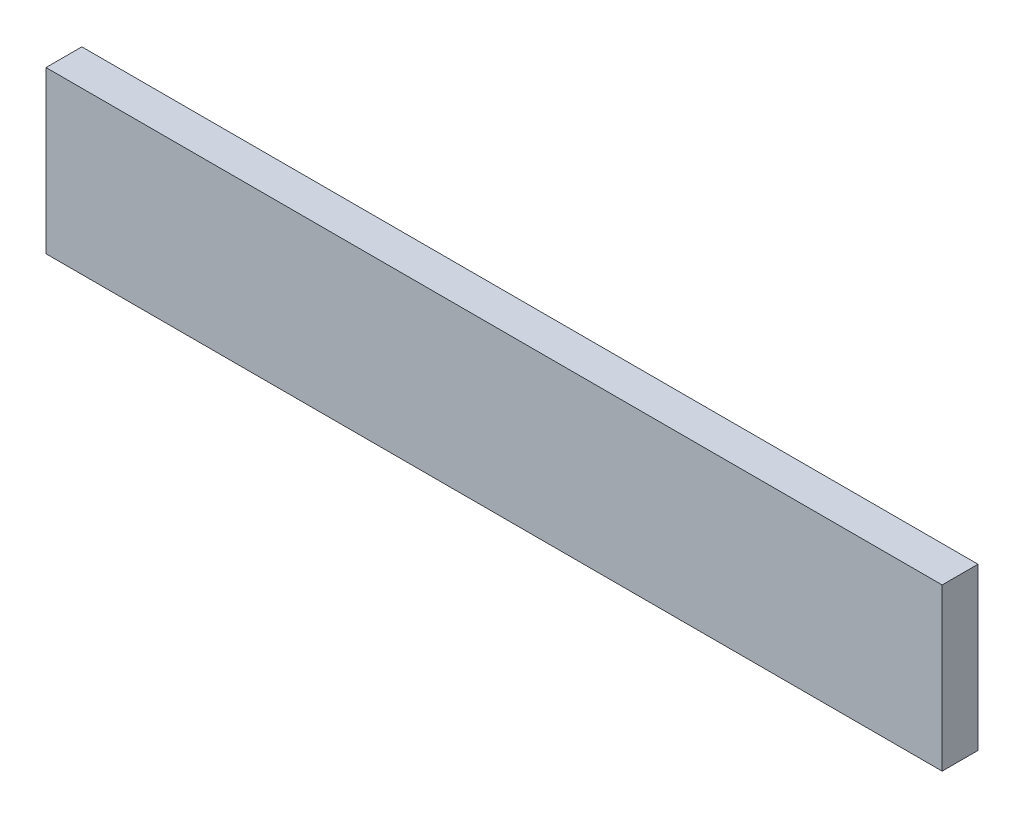
ISO-10303-21;
HEADER;
FILE_DESCRIPTION(('STEP AP214'),'2;1');
FILE_NAME('part.step','',(''),(''),'','','');
FILE_SCHEMA(('AUTOMOTIVE_DESIGN { 1 0 10303 214 1 1 1 1 }'));
ENDSEC;
DATA;
#1=APPLICATION_CONTEXT('core data for automotive mechanical design processes');
#2=APPLICATION_PROTOCOL_DEFINITION('international standard','automotive_design',2000,#1);
#3=PRODUCT_CONTEXT('',#1,'mechanical');
#4=PRODUCT('Part','Part','',(#3));
#5=PRODUCT_RELATED_PRODUCT_CATEGORY('part','',(#4));
#6=PRODUCT_DEFINITION_FORMATION('','',#4);
#7=PRODUCT_DEFINITION_CONTEXT('part definition',#1,'design');
#8=PRODUCT_DEFINITION('design','',#6,#7);
#9=PRODUCT_DEFINITION_SHAPE('','',#8);
#10=(LENGTH_UNIT() NAMED_UNIT(*) SI_UNIT(.MILLI.,.METRE.));
#11=(NAMED_UNIT(*) PLANE_ANGLE_UNIT() SI_UNIT($,.RADIAN.));
#12=(NAMED_UNIT(*) SI_UNIT($,.STERADIAN.) SOLID_ANGLE_UNIT());
#13=UNCERTAINTY_MEASURE_WITH_UNIT(LENGTH_MEASURE(1.E-05),#10,'distance_accuracy_value','');
#14=(GEOMETRIC_REPRESENTATION_CONTEXT(3) GLOBAL_UNCERTAINTY_ASSIGNED_CONTEXT((#13)) GLOBAL_UNIT_ASSIGNED_CONTEXT((#10,
#11,#12)) REPRESENTATION_CONTEXT('',''));
#15=CARTESIAN_POINT('',(0.,0.,0.));
#16=DIRECTION('',(0.,0.,1.));
#17=DIRECTION('',(1.,0.,0.));
#18=AXIS2_PLACEMENT_3D('',#15,#16,#17);
#19=CARTESIAN_POINT('',(0.,0.,10.));
#20=DIRECTION('',(-1.,0.,0.));
#21=DIRECTION('',(0.,0.,1.));
#22=AXIS2_PLACEMENT_3D('',#19,#20,#21);
#23=PLANE('',#22);
#24=DIRECTION('',(0.,1.,0.));
#25=VECTOR('',#24,1.);
#26=CARTESIAN_POINT('',(0.,0.,0.));
#27=LINE('',#26,#25);
#28=CARTESIAN_POINT('',(0.,0.,0.));
#29=VERTEX_POINT('',#28);
#30=CARTESIAN_POINT('',(0.,45.,0.));
#31=VERTEX_POINT('',#30);
#32=EDGE_CURVE('E98',#29,#31,#27,.T.);
#33=ORIENTED_EDGE('',*,*,#32,.T.);
#34=DIRECTION('',(0.,0.,-1.));
#35=VECTOR('',#34,1.);
#36=CARTESIAN_POINT('',(0.,45.,10.));
#37=LINE('',#36,#35);
#38=CARTESIAN_POINT('',(0.,45.,10.));
#39=VERTEX_POINT('',#38);
#40=EDGE_CURVE('E11',#39,#31,#37,.T.);
#41=ORIENTED_EDGE('',*,*,#40,.F.);
#42=DIRECTION('',(0.,1.,0.));
#43=VECTOR('',#42,1.);
#44=CARTESIAN_POINT('',(0.,0.,10.));
#45=LINE('',#44,#43);
#46=CARTESIAN_POINT('',(0.,0.,10.));
#47=VERTEX_POINT('',#46);
#48=EDGE_CURVE('E86',#47,#39,#45,.T.);
#49=ORIENTED_EDGE('',*,*,#48,.F.);
#50=DIRECTION('',(0.,0.,-1.));
#51=VECTOR('',#50,1.);
#52=CARTESIAN_POINT('',(0.,0.,10.));
#53=LINE('',#52,#51);
#54=EDGE_CURVE('E94',#47,#29,#53,.T.);
#55=ORIENTED_EDGE('',*,*,#54,.T.);
#56=EDGE_LOOP('',(#33,#41,#49,#55));
#57=FACE_BOUND('',#56,.T.);
#58=ADVANCED_FACE('F35',(#57),#23,.F.);
#59=CARTESIAN_POINT('',(0.,45.,10.));
#60=DIRECTION('',(0.,-1.,0.));
#61=DIRECTION('',(1.,0.,0.));
#62=AXIS2_PLACEMENT_3D('',#59,#60,#61);
#63=PLANE('',#62);
#64=DIRECTION('',(-1.,0.,0.));
#65=VECTOR('',#64,1.);
#66=CARTESIAN_POINT('',(0.,45.,0.));
#67=LINE('',#66,#65);
#68=CARTESIAN_POINT('',(-250.,45.,0.));
#69=VERTEX_POINT('',#68);
#70=EDGE_CURVE('E90',#31,#69,#67,.T.);
#71=ORIENTED_EDGE('',*,*,#70,.T.);
#72=DIRECTION('',(0.,0.,-1.));
#73=VECTOR('',#72,1.);
#74=CARTESIAN_POINT('',(-250.,45.,10.));
#75=LINE('',#74,#73);
#76=CARTESIAN_POINT('',(-250.,45.,10.));
#77=VERTEX_POINT('',#76);
#78=EDGE_CURVE('E43',#77,#69,#75,.T.);
#79=ORIENTED_EDGE('',*,*,#78,.F.);
#80=DIRECTION('',(-1.,0.,0.));
#81=VECTOR('',#80,1.);
#82=CARTESIAN_POINT('',(0.,45.,10.));
#83=LINE('',#82,#81);
#84=EDGE_CURVE('E81',#39,#77,#83,.T.);
#85=ORIENTED_EDGE('',*,*,#84,.F.);
#86=ORIENTED_EDGE('',*,*,#40,.T.);
#87=EDGE_LOOP('',(#71,#79,#85,#86));
#88=FACE_BOUND('',#87,.T.);
#89=ADVANCED_FACE('F89',(#88),#63,.F.);
#90=CARTESIAN_POINT('',(-250.,0.,10.));
#91=DIRECTION('',(1.,0.,0.));
#92=DIRECTION('',(0.,0.,-1.));
#93=AXIS2_PLACEMENT_3D('',#90,#91,#92);
#94=PLANE('',#93);
#95=DIRECTION('',(0.,-1.,0.));
#96=VECTOR('',#95,1.);
#97=CARTESIAN_POINT('',(-250.,0.,0.));
#98=LINE('',#97,#96);
#99=CARTESIAN_POINT('',(-250.,0.,0.));
#100=VERTEX_POINT('',#99);
#101=EDGE_CURVE('E68',#69,#100,#98,.T.);
#102=ORIENTED_EDGE('',*,*,#101,.T.);
#103=DIRECTION('',(0.,0.,-1.));
#104=VECTOR('',#103,1.);
#105=CARTESIAN_POINT('',(-250.,0.,10.));
#106=LINE('',#105,#104);
#107=CARTESIAN_POINT('',(-250.,0.,10.));
#108=VERTEX_POINT('',#107);
#109=EDGE_CURVE('E91',#108,#100,#106,.T.);
#110=ORIENTED_EDGE('',*,*,#109,.F.);
#111=DIRECTION('',(0.,-1.,0.));
#112=VECTOR('',#111,1.);
#113=CARTESIAN_POINT('',(-250.,0.,10.));
#114=LINE('',#113,#112);
#115=EDGE_CURVE('E84',#77,#108,#114,.T.);
#116=ORIENTED_EDGE('',*,*,#115,.F.);
#117=ORIENTED_EDGE('',*,*,#78,.T.);
#118=EDGE_LOOP('',(#102,#110,#116,#117));
#119=FACE_BOUND('',#118,.T.);
#120=ADVANCED_FACE('F92',(#119),#94,.F.);
#121=CARTESIAN_POINT('',(0.,0.,10.));
#122=DIRECTION('',(0.,1.,0.));
#123=DIRECTION('',(-1.,0.,0.));
#124=AXIS2_PLACEMENT_3D('',#121,#122,#123);
#125=PLANE('',#124);
#126=DIRECTION('',(1.,0.,0.));
#127=VECTOR('',#126,1.);
#128=CARTESIAN_POINT('',(0.,0.,0.));
#129=LINE('',#128,#127);
#130=EDGE_CURVE('E74',#100,#29,#129,.T.);
#131=ORIENTED_EDGE('',*,*,#130,.T.);
#132=ORIENTED_EDGE('',*,*,#54,.F.);
#133=DIRECTION('',(1.,0.,0.));
#134=VECTOR('',#133,1.);
#135=CARTESIAN_POINT('',(0.,0.,10.));
#136=LINE('',#135,#134);
#137=EDGE_CURVE('E51',#108,#47,#136,.T.);
#138=ORIENTED_EDGE('',*,*,#137,.F.);
#139=ORIENTED_EDGE('',*,*,#109,.T.);
#140=EDGE_LOOP('',(#131,#132,#138,#139));
#141=FACE_BOUND('',#140,.T.);
#142=ADVANCED_FACE('F105',(#141),#125,.F.);
#143=CARTESIAN_POINT('',(0.,0.,10.));
#144=DIRECTION('',(0.,0.,1.));
#145=DIRECTION('',(1.,0.,0.));
#146=AXIS2_PLACEMENT_3D('',#143,#144,#145);
#147=PLANE('',#146);
#148=ORIENTED_EDGE('',*,*,#48,.T.);
#149=ORIENTED_EDGE('',*,*,#84,.T.);
#150=ORIENTED_EDGE('',*,*,#115,.T.);
#151=ORIENTED_EDGE('',*,*,#137,.T.);
#152=EDGE_LOOP('',(#148,#149,#150,#151));
#153=FACE_BOUND('',#152,.T.);
#154=ADVANCED_FACE('F82',(#153),#147,.T.);
#155=CARTESIAN_POINT('',(0.,0.,0.));
#156=DIRECTION('',(0.,0.,1.));
#157=DIRECTION('',(1.,0.,0.));
#158=AXIS2_PLACEMENT_3D('',#155,#156,#157);
#159=PLANE('',#158);
#160=ORIENTED_EDGE('',*,*,#32,.F.);
#161=ORIENTED_EDGE('',*,*,#130,.F.);
#162=ORIENTED_EDGE('',*,*,#101,.F.);
#163=ORIENTED_EDGE('',*,*,#70,.F.);
#164=EDGE_LOOP('',(#160,#161,#162,#163));
#165=FACE_BOUND('',#164,.T.);
#166=ADVANCED_FACE('F108',(#165),#159,.F.);
#167=CLOSED_SHELL('',(#58,#89,#120,#142,#154,#166));
#168=MANIFOLD_SOLID_BREP('B2',#167);
#169=ADVANCED_BREP_SHAPE_REPRESENTATION('',(#18,#168),#14);
#170=SHAPE_DEFINITION_REPRESENTATION(#9,#169);
ENDSEC;
END-ISO-10303-21;
